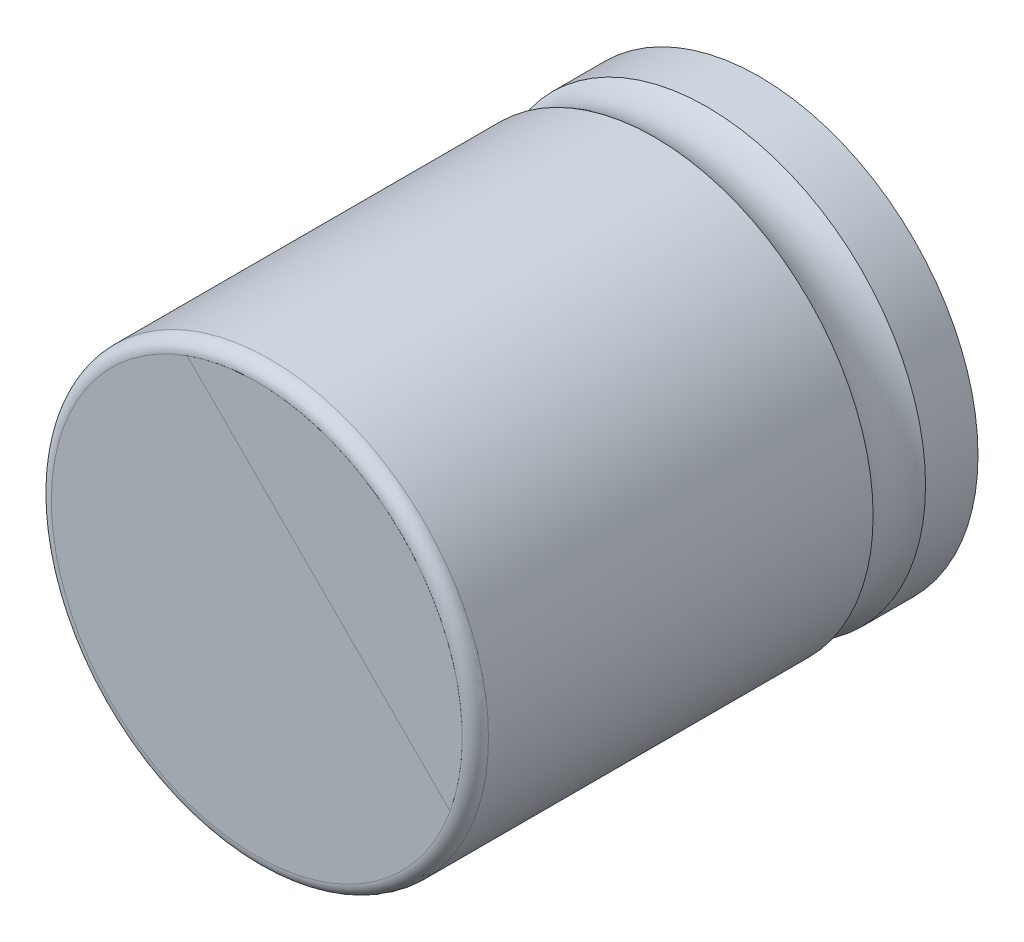
ISO-10303-21;
HEADER;
FILE_DESCRIPTION(('STEP AP214'),'2;1');
FILE_NAME('part.step','',(''),(''),'','','');
FILE_SCHEMA(('AUTOMOTIVE_DESIGN { 1 0 10303 214 1 1 1 1 }'));
ENDSEC;
DATA;
#1=APPLICATION_CONTEXT('core data for automotive mechanical design processes');
#2=APPLICATION_PROTOCOL_DEFINITION('international standard','automotive_design',2000,#1);
#3=PRODUCT_CONTEXT('',#1,'mechanical');
#4=PRODUCT('Part','Part','',(#3));
#5=PRODUCT_RELATED_PRODUCT_CATEGORY('part','',(#4));
#6=PRODUCT_DEFINITION_FORMATION('','',#4);
#7=PRODUCT_DEFINITION_CONTEXT('part definition',#1,'design');
#8=PRODUCT_DEFINITION('design','',#6,#7);
#9=PRODUCT_DEFINITION_SHAPE('','',#8);
#10=(LENGTH_UNIT() NAMED_UNIT(*) SI_UNIT(.MILLI.,.METRE.));
#11=(NAMED_UNIT(*) PLANE_ANGLE_UNIT() SI_UNIT($,.RADIAN.));
#12=(NAMED_UNIT(*) SI_UNIT($,.STERADIAN.) SOLID_ANGLE_UNIT());
#13=UNCERTAINTY_MEASURE_WITH_UNIT(LENGTH_MEASURE(1.E-05),#10,'distance_accuracy_value','');
#14=(GEOMETRIC_REPRESENTATION_CONTEXT(3) GLOBAL_UNCERTAINTY_ASSIGNED_CONTEXT((#13)) GLOBAL_UNIT_ASSIGNED_CONTEXT((#10,
#11,#12)) REPRESENTATION_CONTEXT('',''));
#15=CARTESIAN_POINT('',(0.,0.,0.));
#16=DIRECTION('',(0.,0.,1.));
#17=DIRECTION('',(1.,0.,0.));
#18=AXIS2_PLACEMENT_3D('',#15,#16,#17);
#19=CARTESIAN_POINT('',(-7.33729645980202,-10.7785186965825,3.050316059209));
#20=DIRECTION('',(-3.09086341954809E-08,3.09086346086632E-08,-1.));
#21=DIRECTION('',(-0.707106781186547,0.707106781186547,4.37114099658419E-08));
#22=AXIS2_PLACEMENT_3D('',#19,#20,#21);
#23=PLANE('',#22);
#24=CARTESIAN_POINT('',(-7.33729645980202,-10.7785186965825,3.050316059209));
#25=DIRECTION('',(-3.09086341954809E-08,3.09086346086632E-08,-1.));
#26=DIRECTION('',(0.707106781186548,0.707106781186548,0.));
#27=AXIS2_PLACEMENT_3D('',#24,#25,#26);
#28=CIRCLE('',#27,5.);
#29=CARTESIAN_POINT('',(-3.80176255386928,-7.24298479064976,3.050316059209));
#30=VERTEX_POINT('',#29);
#31=EDGE_CURVE('E11',#30,#30,#28,.T.);
#32=ORIENTED_EDGE('',*,*,#31,.T.);
#33=EDGE_LOOP('',(#32));
#34=FACE_BOUND('',#33,.T.);
#35=ADVANCED_FACE('F17',(#34),#23,.T.);
#36=CARTESIAN_POINT('',(-7.33729627589566,-10.7785188804889,9.000316059209));
#37=DIRECTION('',(-3.09086341954809E-08,3.09086346086632E-08,-1.));
#38=DIRECTION('',(0.707106781186548,0.707106781186548,0.));
#39=AXIS2_PLACEMENT_3D('',#36,#37,#38);
#40=CYLINDRICAL_SURFACE('',#39,5.);
#41=ORIENTED_EDGE('',*,*,#31,.F.);
#42=EDGE_LOOP('',(#41));
#43=FACE_BOUND('',#42,.T.);
#44=CARTESIAN_POINT('',(-7.33729642271166,-10.7785187336728,4.25031605920913));
#45=DIRECTION('',(-3.09086341954809E-08,3.09086346086632E-08,-1.));
#46=DIRECTION('',(-0.707106781186548,-0.707106781186548,0.));
#47=AXIS2_PLACEMENT_3D('',#44,#45,#46);
#48=CIRCLE('',#47,5.);
#49=CARTESIAN_POINT('',(-10.8728303286444,-14.3140526396056,4.25031605920912));
#50=VERTEX_POINT('',#49);
#51=EDGE_CURVE('E27',#50,#50,#48,.T.);
#52=ORIENTED_EDGE('',*,*,#51,.T.);
#53=EDGE_LOOP('',(#52));
#54=FACE_BOUND('',#53,.T.);
#55=ADVANCED_FACE('F107',(#43,#54),#40,.T.);
#56=CARTESIAN_POINT('',(-7.33729640416647,-10.778518752218,4.850316059209));
#57=DIRECTION('',(-3.09086341954809E-08,3.09086346086632E-08,-1.));
#58=DIRECTION('',(-0.707106781186547,0.707106781186547,4.37114099658419E-08));
#59=AXIS2_PLACEMENT_3D('',#56,#57,#58);
#60=TOROIDAL_SURFACE('',#59,5.941071428571,1.116071428571);
#61=CARTESIAN_POINT('',(-7.33729638562131,-10.7785187707632,5.450316059209));
#62=DIRECTION('',(-3.09086341954809E-08,3.09086346086632E-08,-1.));
#63=DIRECTION('',(0.707106781186548,0.707106781186548,0.));
#64=AXIS2_PLACEMENT_3D('',#61,#62,#63);
#65=CIRCLE('',#64,5.);
#66=CARTESIAN_POINT('',(-3.80176247968857,-7.24298486483046,5.450316059209));
#67=VERTEX_POINT('',#66);
#68=EDGE_CURVE('E84',#67,#67,#65,.T.);
#69=ORIENTED_EDGE('',*,*,#68,.T.);
#70=EDGE_LOOP('',(#69));
#71=FACE_BOUND('',#70,.T.);
#72=ORIENTED_EDGE('',*,*,#51,.F.);
#73=EDGE_LOOP('',(#72));
#74=FACE_BOUND('',#73,.T.);
#75=ADVANCED_FACE('F113',(#71,#74),#60,.F.);
#76=ORIENTED_EDGE('',*,*,#68,.F.);
#77=EDGE_LOOP('',(#76));
#78=FACE_BOUND('',#77,.T.);
#79=CARTESIAN_POINT('',(-7.33729611362533,-10.7785190427592,14.250316059209));
#80=DIRECTION('',(3.09086342045479E-08,-3.09086345995963E-08,1.));
#81=DIRECTION('',(0.,-1.,-3.09086345995963E-08));
#82=AXIS2_PLACEMENT_3D('',#79,#80,#81);
#83=CIRCLE('',#82,5.);
#84=CARTESIAN_POINT('',(-7.33729611362533,-15.7785190427592,14.2503159046658));
#85=VERTEX_POINT('',#84);
#86=EDGE_CURVE('E61',#85,#85,#83,.T.);
#87=ORIENTED_EDGE('',*,*,#86,.F.);
#88=EDGE_LOOP('',(#87));
#89=FACE_BOUND('',#88,.T.);
#90=ADVANCED_FACE('F116',(#78,#89),#40,.T.);
#91=CARTESIAN_POINT('',(-7.33729611362533,-10.7785190427592,14.250316059209));
#92=DIRECTION('',(3.09086342045479E-08,-3.09086345995963E-08,1.));
#93=DIRECTION('',(0.,-1.,-3.09086345995963E-08));
#94=AXIS2_PLACEMENT_3D('',#91,#92,#93);
#95=TOROIDAL_SURFACE('',#94,4.7,0.3);
#96=ORIENTED_EDGE('',*,*,#86,.T.);
#97=EDGE_LOOP('',(#96));
#98=FACE_BOUND('',#97,.T.);
#99=CARTESIAN_POINT('',(-7.33729610435274,-10.7785190520318,14.550316059209));
#100=DIRECTION('',(-3.09086342045479E-08,3.09086345995963E-08,-1.));
#101=DIRECTION('',(0.,1.,3.09086345995963E-08));
#102=AXIS2_PLACEMENT_3D('',#99,#100,#101);
#103=CIRCLE('',#102,4.7);
#104=CARTESIAN_POINT('',(-8.93057319034465,-6.35681484129442,14.5503162451238));
#105=VERTEX_POINT('',#104);
#106=CARTESIAN_POINT('',(-2.91559189361524,-12.3717961380231,14.5503158732941));
#107=VERTEX_POINT('',#106);
#108=EDGE_CURVE('E57',#105,#107,#103,.T.);
#109=ORIENTED_EDGE('',*,*,#108,.T.);
#110=CARTESIAN_POINT('',(-7.33729610435274,-10.7785190520318,14.550316059209));
#111=DIRECTION('',(3.09086342045479E-08,-3.09086345995963E-08,1.));
#112=DIRECTION('',(0.,-1.,-3.09086345995963E-08));
#113=AXIS2_PLACEMENT_3D('',#110,#111,#112);
#114=CIRCLE('',#113,4.7);
#115=EDGE_CURVE('E54',#107,#105,#114,.F.);
#116=ORIENTED_EDGE('',*,*,#115,.T.);
#117=EDGE_LOOP('',(#109,#116));
#118=FACE_BOUND('',#117,.T.);
#119=ADVANCED_FACE('F19',(#98,#118),#95,.T.);
#120=CARTESIAN_POINT('',(-5.32095929080454,-8.7621822384836,14.550316059209));
#121=DIRECTION('',(3.09086342045479E-08,-3.09086345995963E-08,1.));
#122=DIRECTION('',(0.707106781186547,-0.707106781186547,-4.37114099658419E-08));
#123=AXIS2_PLACEMENT_3D('',#120,#121,#122);
#124=PLANE('',#123);
#125=DIRECTION('',(-0.707106781186547,0.707106781186547,4.37114099658419E-08));
#126=VECTOR('',#125,1.);
#127=CARTESIAN_POINT('',(-8.9305731903439,-6.35681484129442,14.5503162451238));
#128=LINE('',#127,#126);
#129=EDGE_CURVE('E63',#107,#105,#128,.T.);
#130=ORIENTED_EDGE('',*,*,#129,.T.);
#131=ORIENTED_EDGE('',*,*,#115,.F.);
#132=EDGE_LOOP('',(#130,#131));
#133=FACE_BOUND('',#132,.T.);
#134=ADVANCED_FACE('F64',(#133),#124,.T.);
#135=CARTESIAN_POINT('',(-5.32095929077362,-8.7621822385145,14.551316059209));
#136=DIRECTION('',(3.09086342045479E-08,-3.09086345995963E-08,1.));
#137=DIRECTION('',(0.707106781186547,-0.707106781186547,-4.37114099658419E-08));
#138=AXIS2_PLACEMENT_3D('',#135,#136,#137);
#139=PLANE('',#138);
#140=DIRECTION('',(0.707106781186547,-0.707106781186547,-4.37114099658419E-08));
#141=VECTOR('',#140,1.);
#142=CARTESIAN_POINT('',(-5.92308254194872,-9.3643054896896,14.551316059209));
#143=LINE('',#142,#141);
#144=CARTESIAN_POINT('',(-8.93057319031299,-6.35681484132533,14.5513162451238));
#145=VERTEX_POINT('',#144);
#146=CARTESIAN_POINT('',(-2.91559189358447,-12.3717961380539,14.5513158732941));
#147=VERTEX_POINT('',#146);
#148=EDGE_CURVE('E38',#145,#147,#143,.T.);
#149=ORIENTED_EDGE('',*,*,#148,.T.);
#150=CARTESIAN_POINT('',(-7.33729610432181,-10.7785190520627,14.551316059209));
#151=DIRECTION('',(3.09086342045479E-08,-3.09086345995963E-08,1.));
#152=DIRECTION('',(0.,-1.,-3.09086345995963E-08));
#153=AXIS2_PLACEMENT_3D('',#150,#151,#152);
#154=CIRCLE('',#153,4.7);
#155=EDGE_CURVE('E21',#147,#145,#154,.T.);
#156=ORIENTED_EDGE('',*,*,#155,.T.);
#157=EDGE_LOOP('',(#149,#156));
#158=FACE_BOUND('',#157,.T.);
#159=ADVANCED_FACE('F97',(#158),#139,.T.);
#160=CARTESIAN_POINT('',(-8.93057325216116,-6.35681477947715,12.5503162451239));
#161=DIRECTION('',(-0.707106781186548,-0.707106781186548,0.));
#162=DIRECTION('',(0.707106781186547,-0.707106781186547,-4.37114099658419E-08));
#163=AXIS2_PLACEMENT_3D('',#160,#161,#162);
#164=PLANE('',#163);
#165=ORIENTED_EDGE('',*,*,#129,.F.);
#166=DIRECTION('',(3.09086344020721E-08,-3.09086344020721E-08,1.));
#167=VECTOR('',#166,1.);
#168=CARTESIAN_POINT('',(-2.91559195543265,-12.3717960762057,12.5503158732941));
#169=LINE('',#168,#167);
#170=EDGE_CURVE('E67',#107,#147,#169,.T.);
#171=ORIENTED_EDGE('',*,*,#170,.T.);
#172=ORIENTED_EDGE('',*,*,#148,.F.);
#173=DIRECTION('',(3.09086344020721E-08,-3.09086344020721E-08,1.));
#174=VECTOR('',#173,1.);
#175=CARTESIAN_POINT('',(-8.93057325216116,-6.35681477947715,12.5503162451239));
#176=LINE('',#175,#174);
#177=EDGE_CURVE('E70',#105,#145,#176,.T.);
#178=ORIENTED_EDGE('',*,*,#177,.F.);
#179=EDGE_LOOP('',(#165,#171,#172,#178));
#180=FACE_BOUND('',#179,.T.);
#181=ADVANCED_FACE('F71',(#180),#164,.T.);
#182=CARTESIAN_POINT('',(-7.33729616616999,-10.7785189902145,12.550316059209));
#183=DIRECTION('',(3.09086344020721E-08,-3.09086344020721E-08,1.));
#184=DIRECTION('',(0.707106781186548,0.707106781186548,0.));
#185=AXIS2_PLACEMENT_3D('',#182,#183,#184);
#186=CYLINDRICAL_SURFACE('',#185,4.7);
#187=ORIENTED_EDGE('',*,*,#108,.F.);
#188=ORIENTED_EDGE('',*,*,#177,.T.);
#189=ORIENTED_EDGE('',*,*,#155,.F.);
#190=ORIENTED_EDGE('',*,*,#170,.F.);
#191=EDGE_LOOP('',(#187,#188,#189,#190));
#192=FACE_BOUND('',#191,.T.);
#193=ADVANCED_FACE('F76',(#192),#186,.T.);
#194=CLOSED_SHELL('',(#35,#55,#75,#90,#119,#134,#159,#181,#193));
#195=MANIFOLD_SOLID_BREP('B1',#194);
#196=ADVANCED_BREP_SHAPE_REPRESENTATION('',(#18,#195),#14);
#197=SHAPE_DEFINITION_REPRESENTATION(#9,#196);
ENDSEC;
END-ISO-10303-21;
